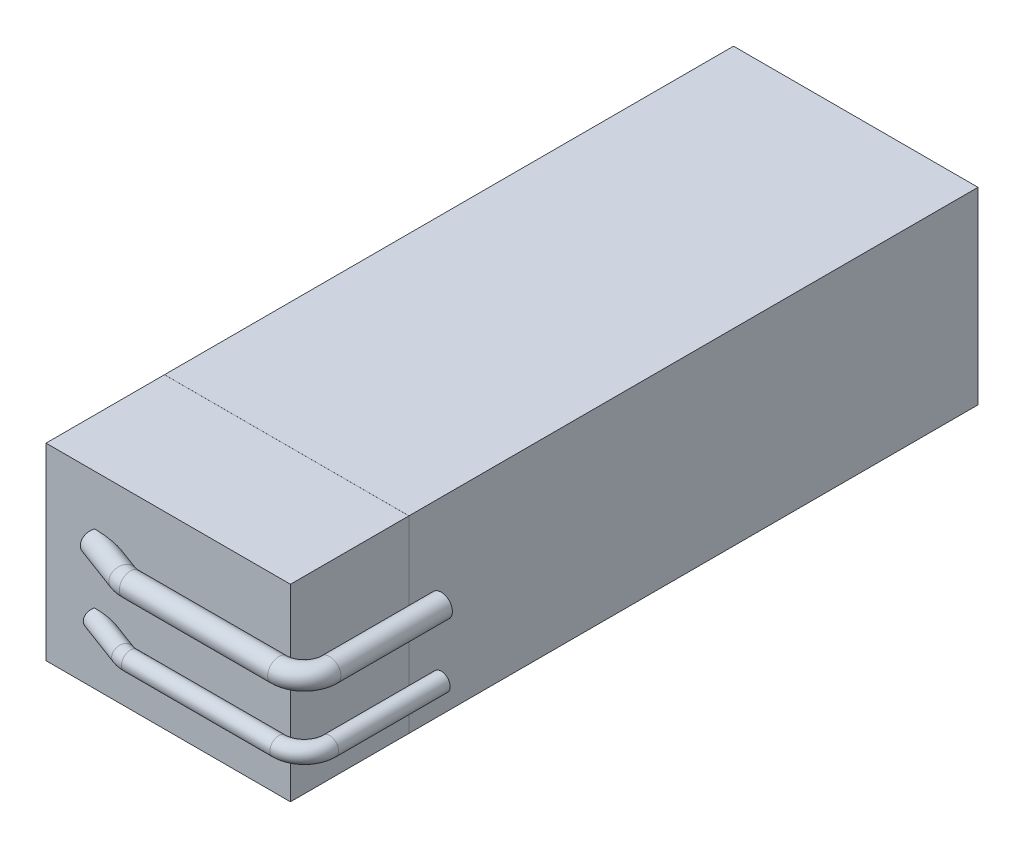
ISO-10303-21;
HEADER;
FILE_DESCRIPTION(('STEP AP214'),'2;1');
FILE_NAME('part.step','',(''),(''),'','','');
FILE_SCHEMA(('AUTOMOTIVE_DESIGN { 1 0 10303 214 1 1 1 1 }'));
ENDSEC;
DATA;
#1=APPLICATION_CONTEXT('core data for automotive mechanical design processes');
#2=APPLICATION_PROTOCOL_DEFINITION('international standard','automotive_design',2000,#1);
#3=PRODUCT_CONTEXT('',#1,'mechanical');
#4=PRODUCT('Part','Part','',(#3));
#5=PRODUCT_RELATED_PRODUCT_CATEGORY('part','',(#4));
#6=PRODUCT_DEFINITION_FORMATION('','',#4);
#7=PRODUCT_DEFINITION_CONTEXT('part definition',#1,'design');
#8=PRODUCT_DEFINITION('design','',#6,#7);
#9=PRODUCT_DEFINITION_SHAPE('','',#8);
#10=(LENGTH_UNIT() NAMED_UNIT(*) SI_UNIT(.MILLI.,.METRE.));
#11=(NAMED_UNIT(*) PLANE_ANGLE_UNIT() SI_UNIT($,.RADIAN.));
#12=(NAMED_UNIT(*) SI_UNIT($,.STERADIAN.) SOLID_ANGLE_UNIT());
#13=UNCERTAINTY_MEASURE_WITH_UNIT(LENGTH_MEASURE(1.E-05),#10,'distance_accuracy_value','');
#14=(GEOMETRIC_REPRESENTATION_CONTEXT(3) GLOBAL_UNCERTAINTY_ASSIGNED_CONTEXT((#13)) GLOBAL_UNIT_ASSIGNED_CONTEXT((#10,
#11,#12)) REPRESENTATION_CONTEXT('',''));
#15=CARTESIAN_POINT('',(0.,0.,0.));
#16=DIRECTION('',(0.,0.,1.));
#17=DIRECTION('',(1.,0.,0.));
#18=AXIS2_PLACEMENT_3D('',#15,#16,#17);
#19=CARTESIAN_POINT('',(48.,37.,0.));
#20=DIRECTION('',(0.,-1.,0.));
#21=DIRECTION('',(0.,0.,-1.));
#22=AXIS2_PLACEMENT_3D('',#19,#20,#21);
#23=PLANE('',#22);
#24=DIRECTION('',(1.,0.,0.));
#25=VECTOR('',#24,1.);
#26=CARTESIAN_POINT('',(0.,37.,111.742100003703));
#27=LINE('',#26,#25);
#28=CARTESIAN_POINT('',(0.,37.,111.742100003703));
#29=VERTEX_POINT('',#28);
#30=CARTESIAN_POINT('',(48.,37.,111.742100003703));
#31=VERTEX_POINT('',#30);
#32=EDGE_CURVE('E114',#29,#31,#27,.T.);
#33=ORIENTED_EDGE('',*,*,#32,.F.);
#34=DIRECTION('',(0.,0.,1.));
#35=VECTOR('',#34,1.);
#36=CARTESIAN_POINT('',(0.,37.,0.));
#37=LINE('',#36,#35);
#38=CARTESIAN_POINT('',(0.,37.,135.));
#39=VERTEX_POINT('',#38);
#40=EDGE_CURVE('E59',#29,#39,#37,.T.);
#41=ORIENTED_EDGE('',*,*,#40,.T.);
#42=DIRECTION('',(-1.,0.,0.));
#43=VECTOR('',#42,1.);
#44=CARTESIAN_POINT('',(48.,37.,135.));
#45=LINE('',#44,#43);
#46=CARTESIAN_POINT('',(48.,37.,135.));
#47=VERTEX_POINT('',#46);
#48=EDGE_CURVE('E151',#47,#39,#45,.T.);
#49=ORIENTED_EDGE('',*,*,#48,.F.);
#50=DIRECTION('',(0.,0.,1.));
#51=VECTOR('',#50,1.);
#52=CARTESIAN_POINT('',(48.,37.,0.));
#53=LINE('',#52,#51);
#54=EDGE_CURVE('E130',#31,#47,#53,.T.);
#55=ORIENTED_EDGE('',*,*,#54,.F.);
#56=EDGE_LOOP('',(#33,#41,#49,#55));
#57=FACE_BOUND('',#56,.T.);
#58=ADVANCED_FACE('F56',(#57),#23,.F.);
#59=CARTESIAN_POINT('',(48.,0.,0.));
#60=DIRECTION('',(0.,1.,0.));
#61=DIRECTION('',(0.,0.,1.));
#62=AXIS2_PLACEMENT_3D('',#59,#60,#61);
#63=PLANE('',#62);
#64=DIRECTION('',(-1.,0.,0.));
#65=VECTOR('',#64,1.);
#66=CARTESIAN_POINT('',(0.,0.,111.742100003703));
#67=LINE('',#66,#65);
#68=CARTESIAN_POINT('',(48.,0.,111.742100003703));
#69=VERTEX_POINT('',#68);
#70=CARTESIAN_POINT('',(0.,0.,111.742100003703));
#71=VERTEX_POINT('',#70);
#72=EDGE_CURVE('E12',#69,#71,#67,.T.);
#73=ORIENTED_EDGE('',*,*,#72,.F.);
#74=DIRECTION('',(0.,0.,-1.));
#75=VECTOR('',#74,1.);
#76=CARTESIAN_POINT('',(48.,0.,0.));
#77=LINE('',#76,#75);
#78=CARTESIAN_POINT('',(48.,0.,135.));
#79=VERTEX_POINT('',#78);
#80=EDGE_CURVE('E148',#79,#69,#77,.T.);
#81=ORIENTED_EDGE('',*,*,#80,.F.);
#82=DIRECTION('',(-1.,0.,0.));
#83=VECTOR('',#82,1.);
#84=CARTESIAN_POINT('',(48.,0.,135.));
#85=LINE('',#84,#83);
#86=CARTESIAN_POINT('',(0.,0.,135.));
#87=VERTEX_POINT('',#86);
#88=EDGE_CURVE('E137',#79,#87,#85,.T.);
#89=ORIENTED_EDGE('',*,*,#88,.T.);
#90=DIRECTION('',(0.,0.,-1.));
#91=VECTOR('',#90,1.);
#92=CARTESIAN_POINT('',(0.,0.,0.));
#93=LINE('',#92,#91);
#94=EDGE_CURVE('E141',#87,#71,#93,.T.);
#95=ORIENTED_EDGE('',*,*,#94,.T.);
#96=EDGE_LOOP('',(#73,#81,#89,#95));
#97=FACE_BOUND('',#96,.T.);
#98=ADVANCED_FACE('F220',(#97),#63,.F.);
#99=CARTESIAN_POINT('',(48.,0.,0.));
#100=DIRECTION('',(1.,0.,0.));
#101=DIRECTION('',(0.,0.,-1.));
#102=AXIS2_PLACEMENT_3D('',#99,#100,#101);
#103=PLANE('',#102);
#104=ORIENTED_EDGE('',*,*,#80,.T.);
#105=DIRECTION('',(0.,-1.,0.));
#106=VECTOR('',#105,1.);
#107=CARTESIAN_POINT('',(48.,0.,111.742100003703));
#108=LINE('',#107,#106);
#109=EDGE_CURVE('E66',#31,#69,#108,.T.);
#110=ORIENTED_EDGE('',*,*,#109,.F.);
#111=ORIENTED_EDGE('',*,*,#54,.T.);
#112=DIRECTION('',(0.,-1.,0.));
#113=VECTOR('',#112,1.);
#114=CARTESIAN_POINT('',(48.,0.,135.));
#115=LINE('',#114,#113);
#116=EDGE_CURVE('E155',#47,#79,#115,.T.);
#117=ORIENTED_EDGE('',*,*,#116,.T.);
#118=EDGE_LOOP('',(#104,#110,#111,#117));
#119=FACE_BOUND('',#118,.T.);
#120=ADVANCED_FACE('F215',(#119),#103,.T.);
#121=CARTESIAN_POINT('',(0.,0.,0.));
#122=DIRECTION('',(1.,0.,0.));
#123=DIRECTION('',(0.,0.,-1.));
#124=AXIS2_PLACEMENT_3D('',#121,#122,#123);
#125=PLANE('',#124);
#126=DIRECTION('',(0.,1.,0.));
#127=VECTOR('',#126,1.);
#128=CARTESIAN_POINT('',(0.,0.,111.742100003703));
#129=LINE('',#128,#127);
#130=EDGE_CURVE('E117',#71,#29,#129,.T.);
#131=ORIENTED_EDGE('',*,*,#130,.F.);
#132=ORIENTED_EDGE('',*,*,#94,.F.);
#133=DIRECTION('',(0.,-1.,0.));
#134=VECTOR('',#133,1.);
#135=CARTESIAN_POINT('',(0.,0.,135.));
#136=LINE('',#135,#134);
#137=EDGE_CURVE('E135',#39,#87,#136,.T.);
#138=ORIENTED_EDGE('',*,*,#137,.F.);
#139=ORIENTED_EDGE('',*,*,#40,.F.);
#140=EDGE_LOOP('',(#131,#132,#138,#139));
#141=FACE_BOUND('',#140,.T.);
#142=ADVANCED_FACE('F134',(#141),#125,.F.);
#143=CARTESIAN_POINT('',(48.,0.,135.));
#144=DIRECTION('',(0.,0.,-1.));
#145=DIRECTION('',(-1.,0.,0.));
#146=AXIS2_PLACEMENT_3D('',#143,#144,#145);
#147=PLANE('',#146);
#148=DIRECTION('',(0.,-1.,0.));
#149=VECTOR('',#148,1.);
#150=CARTESIAN_POINT('',(9.55982750656041,0.,135.));
#151=LINE('',#150,#149);
#152=CARTESIAN_POINT('',(9.55982750656041,27.1877252010003,135.));
#153=VERTEX_POINT('',#152);
#154=CARTESIAN_POINT('',(9.55982750656041,22.8122747989997,135.));
#155=VERTEX_POINT('',#154);
#156=EDGE_CURVE('E168',#153,#155,#151,.T.);
#157=ORIENTED_EDGE('',*,*,#156,.F.);
#158=CARTESIAN_POINT('',(9.55982750656043,25.,135.));
#159=DIRECTION('',(0.,0.,-1.));
#160=DIRECTION('',(-1.,0.,0.));
#161=AXIS2_PLACEMENT_3D('',#158,#159,#160);
#162=ELLIPSE('',#161,6.26967326638381,2.18772520100031);
#163=EDGE_CURVE('E188',#155,#153,#162,.F.);
#164=ORIENTED_EDGE('',*,*,#163,.F.);
#165=EDGE_LOOP('',(#157,#164));
#166=FACE_BOUND('',#165,.T.);
#167=DIRECTION('',(0.,-1.,0.));
#168=VECTOR('',#167,1.);
#169=CARTESIAN_POINT('',(9.55982750656041,0.,135.));
#170=LINE('',#169,#168);
#171=CARTESIAN_POINT('',(9.55982750656041,13.75,135.));
#172=VERTEX_POINT('',#171);
#173=CARTESIAN_POINT('',(9.55982750656041,10.25,135.));
#174=VERTEX_POINT('',#173);
#175=EDGE_CURVE('E163',#172,#174,#170,.T.);
#176=ORIENTED_EDGE('',*,*,#175,.F.);
#177=CARTESIAN_POINT('',(9.55982750656043,12.,135.));
#178=DIRECTION('',(0.,0.,-1.));
#179=DIRECTION('',(-1.,0.,0.));
#180=AXIS2_PLACEMENT_3D('',#177,#178,#179);
#181=ELLIPSE('',#180,5.01522230084241,1.75);
#182=EDGE_CURVE('E162',#174,#172,#181,.F.);
#183=ORIENTED_EDGE('',*,*,#182,.F.);
#184=EDGE_LOOP('',(#176,#183));
#185=FACE_BOUND('',#184,.T.);
#186=ORIENTED_EDGE('',*,*,#137,.T.);
#187=ORIENTED_EDGE('',*,*,#88,.F.);
#188=ORIENTED_EDGE('',*,*,#116,.F.);
#189=ORIENTED_EDGE('',*,*,#48,.T.);
#190=EDGE_LOOP('',(#186,#187,#188,#189));
#191=FACE_BOUND('',#190,.T.);
#192=ADVANCED_FACE('F219',(#166,#185,#191),#147,.F.);
#193=CARTESIAN_POINT('',(9.55982750656041,12.,135.));
#194=DIRECTION('',(0.937145933275446,0.,0.348937673152804));
#195=DIRECTION('',(0.348937673152804,0.,-0.937145933275446));
#196=AXIS2_PLACEMENT_3D('',#193,#194,#195);
#197=PLANE('',#196);
#198=CARTESIAN_POINT('',(9.55982750656041,12.,135.));
#199=DIRECTION('',(0.937145933275446,0.,0.348937673152804));
#200=DIRECTION('',(0.348937673152804,0.,-0.937145933275446));
#201=AXIS2_PLACEMENT_3D('',#198,#199,#200);
#202=CIRCLE('',#201,1.75);
#203=EDGE_CURVE('E158',#172,#174,#202,.T.);
#204=ORIENTED_EDGE('',*,*,#203,.F.);
#205=ORIENTED_EDGE('',*,*,#175,.T.);
#206=EDGE_LOOP('',(#204,#205));
#207=FACE_BOUND('',#206,.T.);
#208=ADVANCED_FACE('F280',(#207),#197,.F.);
#209=CARTESIAN_POINT('',(18.4574449031654,12.,138.312946042591));
#210=DIRECTION('',(-0.937145933275446,0.,-0.348937673152804));
#211=DIRECTION('',(-0.348937673152804,0.,0.937145933275446));
#212=AXIS2_PLACEMENT_3D('',#209,#210,#211);
#213=CYLINDRICAL_SURFACE('',#212,1.75);
#214=CARTESIAN_POINT('',(18.4574449031654,12.,138.312946042591));
#215=DIRECTION('',(0.937145933275445,0.,0.348937673152806));
#216=DIRECTION('',(0.348937673152806,0.,-0.937145933275445));
#217=AXIS2_PLACEMENT_3D('',#214,#215,#216);
#218=CIRCLE('',#217,1.75);
#219=CARTESIAN_POINT('',(17.846803975148,12.,139.952951425823));
#220=VERTEX_POINT('',#219);
#221=EDGE_CURVE('E164',#220,#220,#218,.T.);
#222=ORIENTED_EDGE('',*,*,#221,.F.);
#223=EDGE_LOOP('',(#222));
#224=FACE_BOUND('',#223,.T.);
#225=ORIENTED_EDGE('',*,*,#203,.T.);
#226=ORIENTED_EDGE('',*,*,#182,.T.);
#227=EDGE_LOOP('',(#225,#226));
#228=FACE_BOUND('',#227,.T.);
#229=ADVANCED_FACE('F277',(#224,#228),#213,.T.);
#230=CARTESIAN_POINT('',(54.3424294324666,12.,111.732100003703));
#231=DIRECTION('',(0.,0.,-1.));
#232=DIRECTION('',(-1.,0.,0.));
#233=AXIS2_PLACEMENT_3D('',#230,#231,#232);
#234=PLANE('',#233);
#235=CARTESIAN_POINT('',(54.3424294324666,12.,111.732100003703));
#236=DIRECTION('',(0.,0.,-1.));
#237=DIRECTION('',(-1.,0.,0.));
#238=AXIS2_PLACEMENT_3D('',#235,#236,#237);
#239=CIRCLE('',#238,1.75);
#240=CARTESIAN_POINT('',(52.5924294324666,12.,111.732100003703));
#241=VERTEX_POINT('',#240);
#242=EDGE_CURVE('E180',#241,#241,#239,.T.);
#243=ORIENTED_EDGE('',*,*,#242,.T.);
#244=EDGE_LOOP('',(#243));
#245=FACE_BOUND('',#244,.T.);
#246=ADVANCED_FACE('F258',(#245),#234,.T.);
#247=CARTESIAN_POINT('',(54.3424294324666,12.,111.732100003703));
#248=DIRECTION('',(0.,0.,1.));
#249=DIRECTION('',(1.,0.,0.));
#250=AXIS2_PLACEMENT_3D('',#247,#248,#249);
#251=CYLINDRICAL_SURFACE('',#250,1.75);
#252=CARTESIAN_POINT('',(54.3424294324666,12.,133.627216376214));
#253=DIRECTION('',(0.,0.,-1.));
#254=DIRECTION('',(-1.,0.,0.));
#255=AXIS2_PLACEMENT_3D('',#252,#253,#254);
#256=CIRCLE('',#255,1.75);
#257=CARTESIAN_POINT('',(56.092429432466,12.,133.627216376214));
#258=VERTEX_POINT('',#257);
#259=EDGE_CURVE('E176',#258,#258,#256,.T.);
#260=ORIENTED_EDGE('',*,*,#259,.T.);
#261=EDGE_LOOP('',(#260));
#262=FACE_BOUND('',#261,.T.);
#263=ORIENTED_EDGE('',*,*,#242,.F.);
#264=EDGE_LOOP('',(#263));
#265=FACE_BOUND('',#264,.T.);
#266=ADVANCED_FACE('F262',(#262,#265),#251,.T.);
#267=CARTESIAN_POINT('',(49.3424294324666,12.,133.627216376214));
#268=DIRECTION('',(0.,-1.,0.));
#269=DIRECTION('',(0.,0.,-1.));
#270=AXIS2_PLACEMENT_3D('',#267,#268,#269);
#271=TOROIDAL_SURFACE('',#270,4.99999999999938,1.75);
#272=CARTESIAN_POINT('',(49.3424294324665,12.,138.627216376214));
#273=DIRECTION('',(1.,0.,0.));
#274=DIRECTION('',(0.,0.,-1.));
#275=AXIS2_PLACEMENT_3D('',#272,#273,#274);
#276=CIRCLE('',#275,1.75);
#277=CARTESIAN_POINT('',(49.3424294324665,12.,140.377216376213));
#278=VERTEX_POINT('',#277);
#279=EDGE_CURVE('E172',#278,#278,#276,.T.);
#280=CARTESIAN_POINT('',(49.3424294324666,12.,133.627216376214));
#281=DIRECTION('',(0.,-1.,0.));
#282=DIRECTION('',(0.,0.,-1.));
#283=AXIS2_PLACEMENT_3D('',#280,#281,#282);
#284=CIRCLE('',#283,6.74999999999938);
#285=EDGE_CURVE('',#258,#278,#284,.T.);
#286=ORIENTED_EDGE('',*,*,#259,.F.);
#287=ORIENTED_EDGE('',*,*,#279,.T.);
#288=ORIENTED_EDGE('',*,*,#285,.T.);
#289=ORIENTED_EDGE('',*,*,#285,.F.);
#290=EDGE_LOOP('',(#286,#288,#287,#289));
#291=FACE_BOUND('',#290,.T.);
#292=ADVANCED_FACE('F265',(#291),#271,.T.);
#293=CARTESIAN_POINT('',(49.3424294324666,12.,138.627216376214));
#294=DIRECTION('',(-1.,0.,0.));
#295=DIRECTION('',(0.,0.,1.));
#296=AXIS2_PLACEMENT_3D('',#293,#294,#295);
#297=CYLINDRICAL_SURFACE('',#296,1.75);
#298=CARTESIAN_POINT('',(20.2021332689294,12.,138.627216376214));
#299=DIRECTION('',(1.,0.,0.));
#300=DIRECTION('',(0.,0.,-1.));
#301=AXIS2_PLACEMENT_3D('',#298,#299,#300);
#302=CIRCLE('',#301,1.75);
#303=CARTESIAN_POINT('',(20.2021332689294,12.,140.377216376214));
#304=VERTEX_POINT('',#303);
#305=EDGE_CURVE('E169',#304,#304,#302,.T.);
#306=ORIENTED_EDGE('',*,*,#305,.T.);
#307=EDGE_LOOP('',(#306));
#308=FACE_BOUND('',#307,.T.);
#309=ORIENTED_EDGE('',*,*,#279,.F.);
#310=EDGE_LOOP('',(#309));
#311=FACE_BOUND('',#310,.T.);
#312=ADVANCED_FACE('F269',(#308,#311),#297,.T.);
#313=CARTESIAN_POINT('',(20.2021332689294,12.,133.627216376214));
#314=DIRECTION('',(0.,-1.,0.));
#315=DIRECTION('',(0.,0.,-1.));
#316=AXIS2_PLACEMENT_3D('',#313,#314,#315);
#317=TOROIDAL_SURFACE('',#316,5.,1.75);
#318=CARTESIAN_POINT('',(20.2021332689294,12.,133.627216376214));
#319=DIRECTION('',(0.,-1.,0.));
#320=DIRECTION('',(0.,0.,-1.));
#321=AXIS2_PLACEMENT_3D('',#318,#319,#320);
#322=CIRCLE('',#321,6.75000000000001);
#323=EDGE_CURVE('',#304,#220,#322,.T.);
#324=ORIENTED_EDGE('',*,*,#305,.F.);
#325=ORIENTED_EDGE('',*,*,#221,.T.);
#326=ORIENTED_EDGE('',*,*,#323,.T.);
#327=ORIENTED_EDGE('',*,*,#323,.F.);
#328=EDGE_LOOP('',(#324,#326,#325,#327));
#329=FACE_BOUND('',#328,.T.);
#330=ADVANCED_FACE('F256',(#329),#317,.T.);
#331=CARTESIAN_POINT('',(9.55982750656041,25.,135.));
#332=DIRECTION('',(0.937145933275446,0.,0.348937673152804));
#333=DIRECTION('',(0.348937673152804,0.,-0.937145933275446));
#334=AXIS2_PLACEMENT_3D('',#331,#332,#333);
#335=PLANE('',#334);
#336=CARTESIAN_POINT('',(9.55982750656041,25.,135.));
#337=DIRECTION('',(0.937145933275446,0.,0.348937673152804));
#338=DIRECTION('',(0.348937673152804,0.,-0.937145933275446));
#339=AXIS2_PLACEMENT_3D('',#336,#337,#338);
#340=CIRCLE('',#339,2.18772520100031);
#341=EDGE_CURVE('E184',#153,#155,#340,.T.);
#342=ORIENTED_EDGE('',*,*,#341,.F.);
#343=ORIENTED_EDGE('',*,*,#156,.T.);
#344=EDGE_LOOP('',(#342,#343));
#345=FACE_BOUND('',#344,.T.);
#346=ADVANCED_FACE('F252',(#345),#335,.F.);
#347=CARTESIAN_POINT('',(18.4574449031654,25.,138.312946042591));
#348=DIRECTION('',(-0.937145933275446,0.,-0.348937673152804));
#349=DIRECTION('',(-0.348937673152804,0.,0.937145933275446));
#350=AXIS2_PLACEMENT_3D('',#347,#348,#349);
#351=CYLINDRICAL_SURFACE('',#350,2.18772520100031);
#352=CARTESIAN_POINT('',(18.4574449031654,25.,138.312946042591));
#353=DIRECTION('',(0.937145933275445,0.,0.348937673152806));
#354=DIRECTION('',(0.348937673152806,0.,-0.937145933275445));
#355=AXIS2_PLACEMENT_3D('',#352,#353,#354);
#356=CIRCLE('',#355,2.18772520100031);
#357=CARTESIAN_POINT('',(17.6940651620306,25.,140.363163817833));
#358=VERTEX_POINT('',#357);
#359=EDGE_CURVE('E124',#358,#358,#356,.T.);
#360=ORIENTED_EDGE('',*,*,#359,.F.);
#361=EDGE_LOOP('',(#360));
#362=FACE_BOUND('',#361,.T.);
#363=ORIENTED_EDGE('',*,*,#341,.T.);
#364=ORIENTED_EDGE('',*,*,#163,.T.);
#365=EDGE_LOOP('',(#363,#364));
#366=FACE_BOUND('',#365,.T.);
#367=ADVANCED_FACE('F249',(#362,#366),#351,.T.);
#368=CARTESIAN_POINT('',(54.3424294324666,25.,111.732100003703));
#369=DIRECTION('',(0.,0.,-1.));
#370=DIRECTION('',(-1.,0.,0.));
#371=AXIS2_PLACEMENT_3D('',#368,#369,#370);
#372=PLANE('',#371);
#373=CARTESIAN_POINT('',(54.3424294324666,25.,111.732100003703));
#374=DIRECTION('',(0.,0.,-1.));
#375=DIRECTION('',(-1.,0.,0.));
#376=AXIS2_PLACEMENT_3D('',#373,#374,#375);
#377=CIRCLE('',#376,2.18772520100031);
#378=CARTESIAN_POINT('',(52.1547042314663,25.,111.732100003703));
#379=VERTEX_POINT('',#378);
#380=EDGE_CURVE('E204',#379,#379,#377,.T.);
#381=ORIENTED_EDGE('',*,*,#380,.T.);
#382=EDGE_LOOP('',(#381));
#383=FACE_BOUND('',#382,.T.);
#384=ADVANCED_FACE('F233',(#383),#372,.T.);
#385=CARTESIAN_POINT('',(54.3424294324666,25.,111.732100003703));
#386=DIRECTION('',(0.,0.,1.));
#387=DIRECTION('',(1.,0.,0.));
#388=AXIS2_PLACEMENT_3D('',#385,#386,#387);
#389=CYLINDRICAL_SURFACE('',#388,2.18772520100031);
#390=CARTESIAN_POINT('',(54.3424294324666,25.,133.627216376214));
#391=DIRECTION('',(0.,0.,-1.));
#392=DIRECTION('',(-1.,0.,0.));
#393=AXIS2_PLACEMENT_3D('',#390,#391,#392);
#394=CIRCLE('',#393,2.18772520100031);
#395=CARTESIAN_POINT('',(56.5301546334663,25.,133.627216376214));
#396=VERTEX_POINT('',#395);
#397=EDGE_CURVE('E200',#396,#396,#394,.T.);
#398=ORIENTED_EDGE('',*,*,#397,.T.);
#399=EDGE_LOOP('',(#398));
#400=FACE_BOUND('',#399,.T.);
#401=ORIENTED_EDGE('',*,*,#380,.F.);
#402=EDGE_LOOP('',(#401));
#403=FACE_BOUND('',#402,.T.);
#404=ADVANCED_FACE('F234',(#400,#403),#389,.T.);
#405=CARTESIAN_POINT('',(49.3424294324666,25.,133.627216376214));
#406=DIRECTION('',(0.,-1.,0.));
#407=DIRECTION('',(0.,0.,-1.));
#408=AXIS2_PLACEMENT_3D('',#405,#406,#407);
#409=TOROIDAL_SURFACE('',#408,4.99999999999938,2.18772520100031);
#410=CARTESIAN_POINT('',(49.3424294324665,25.,138.627216376214));
#411=DIRECTION('',(1.,0.,0.));
#412=DIRECTION('',(0.,0.,-1.));
#413=AXIS2_PLACEMENT_3D('',#410,#411,#412);
#414=CIRCLE('',#413,2.18772520100031);
#415=CARTESIAN_POINT('',(49.3424294324665,25.,140.814941577214));
#416=VERTEX_POINT('',#415);
#417=EDGE_CURVE('E196',#416,#416,#414,.T.);
#418=CARTESIAN_POINT('',(49.3424294324666,25.,133.627216376214));
#419=DIRECTION('',(0.,-1.,0.));
#420=DIRECTION('',(0.,0.,-1.));
#421=AXIS2_PLACEMENT_3D('',#418,#419,#420);
#422=CIRCLE('',#421,7.18772520099969);
#423=EDGE_CURVE('',#396,#416,#422,.T.);
#424=ORIENTED_EDGE('',*,*,#397,.F.);
#425=ORIENTED_EDGE('',*,*,#417,.T.);
#426=ORIENTED_EDGE('',*,*,#423,.T.);
#427=ORIENTED_EDGE('',*,*,#423,.F.);
#428=EDGE_LOOP('',(#424,#426,#425,#427));
#429=FACE_BOUND('',#428,.T.);
#430=ADVANCED_FACE('F237',(#429),#409,.T.);
#431=CARTESIAN_POINT('',(49.3424294324666,25.,138.627216376214));
#432=DIRECTION('',(-1.,0.,0.));
#433=DIRECTION('',(0.,0.,1.));
#434=AXIS2_PLACEMENT_3D('',#431,#432,#433);
#435=CYLINDRICAL_SURFACE('',#434,2.18772520100031);
#436=CARTESIAN_POINT('',(20.2021332689294,25.,138.627216376214));
#437=DIRECTION('',(1.,0.,0.));
#438=DIRECTION('',(0.,0.,-1.));
#439=AXIS2_PLACEMENT_3D('',#436,#437,#438);
#440=CIRCLE('',#439,2.18772520100031);
#441=CARTESIAN_POINT('',(20.2021332689294,25.,140.814941577214));
#442=VERTEX_POINT('',#441);
#443=EDGE_CURVE('E192',#442,#442,#440,.T.);
#444=ORIENTED_EDGE('',*,*,#443,.T.);
#445=EDGE_LOOP('',(#444));
#446=FACE_BOUND('',#445,.T.);
#447=ORIENTED_EDGE('',*,*,#417,.F.);
#448=EDGE_LOOP('',(#447));
#449=FACE_BOUND('',#448,.T.);
#450=ADVANCED_FACE('F241',(#446,#449),#435,.T.);
#451=CARTESIAN_POINT('',(20.2021332689294,25.,133.627216376214));
#452=DIRECTION('',(0.,-1.,0.));
#453=DIRECTION('',(0.,0.,-1.));
#454=AXIS2_PLACEMENT_3D('',#451,#452,#453);
#455=TOROIDAL_SURFACE('',#454,5.,2.18772520100031);
#456=CARTESIAN_POINT('',(20.2021332689294,25.,133.627216376214));
#457=DIRECTION('',(0.,-1.,0.));
#458=DIRECTION('',(0.,0.,-1.));
#459=AXIS2_PLACEMENT_3D('',#456,#457,#458);
#460=CIRCLE('',#459,7.18772520100031);
#461=EDGE_CURVE('',#442,#358,#460,.T.);
#462=ORIENTED_EDGE('',*,*,#443,.F.);
#463=ORIENTED_EDGE('',*,*,#359,.T.);
#464=ORIENTED_EDGE('',*,*,#461,.T.);
#465=ORIENTED_EDGE('',*,*,#461,.F.);
#466=EDGE_LOOP('',(#462,#464,#463,#465));
#467=FACE_BOUND('',#466,.T.);
#468=ADVANCED_FACE('F232',(#467),#455,.T.);
#469=CARTESIAN_POINT('',(0.,0.,111.742100003703));
#470=DIRECTION('',(0.,0.,-1.));
#471=DIRECTION('',(-1.,0.,0.));
#472=AXIS2_PLACEMENT_3D('',#469,#470,#471);
#473=PLANE('',#472);
#474=ORIENTED_EDGE('',*,*,#130,.T.);
#475=ORIENTED_EDGE('',*,*,#32,.T.);
#476=ORIENTED_EDGE('',*,*,#109,.T.);
#477=ORIENTED_EDGE('',*,*,#72,.T.);
#478=EDGE_LOOP('',(#474,#475,#476,#477));
#479=FACE_BOUND('',#478,.T.);
#480=ADVANCED_FACE('F118',(#479),#473,.T.);
#481=CLOSED_SHELL('',(#58,#98,#120,#142,#192,#208,#229,#246,#266,#292,#312,#330,#346,#367,#384,
#404,#430,#450,#468,#480));
#482=MANIFOLD_SOLID_BREP('B2',#481);
#483=CARTESIAN_POINT('',(48.,0.,0.));
#484=DIRECTION('',(0.,0.,1.));
#485=DIRECTION('',(1.,0.,0.));
#486=AXIS2_PLACEMENT_3D('',#483,#484,#485);
#487=PLANE('',#486);
#488=DIRECTION('',(0.,1.,0.));
#489=VECTOR('',#488,1.);
#490=CARTESIAN_POINT('',(0.,0.,0.));
#491=LINE('',#490,#489);
#492=CARTESIAN_POINT('',(0.,0.,0.));
#493=VERTEX_POINT('',#492);
#494=CARTESIAN_POINT('',(0.,37.,0.));
#495=VERTEX_POINT('',#494);
#496=EDGE_CURVE('E549',#493,#495,#491,.T.);
#497=ORIENTED_EDGE('',*,*,#496,.T.);
#498=DIRECTION('',(-1.,0.,0.));
#499=VECTOR('',#498,1.);
#500=CARTESIAN_POINT('',(48.,37.,0.));
#501=LINE('',#500,#499);
#502=CARTESIAN_POINT('',(48.,37.,0.));
#503=VERTEX_POINT('',#502);
#504=EDGE_CURVE('E54',#503,#495,#501,.T.);
#505=ORIENTED_EDGE('',*,*,#504,.F.);
#506=DIRECTION('',(0.,1.,0.));
#507=VECTOR('',#506,1.);
#508=CARTESIAN_POINT('',(48.,0.,0.));
#509=LINE('',#508,#507);
#510=CARTESIAN_POINT('',(48.,0.,0.));
#511=VERTEX_POINT('',#510);
#512=EDGE_CURVE('E543',#511,#503,#509,.T.);
#513=ORIENTED_EDGE('',*,*,#512,.F.);
#514=DIRECTION('',(-1.,0.,0.));
#515=VECTOR('',#514,1.);
#516=CARTESIAN_POINT('',(48.,0.,0.));
#517=LINE('',#516,#515);
#518=EDGE_CURVE('E496',#511,#493,#517,.T.);
#519=ORIENTED_EDGE('',*,*,#518,.T.);
#520=EDGE_LOOP('',(#497,#505,#513,#519));
#521=FACE_BOUND('',#520,.T.);
#522=ADVANCED_FACE('F488',(#521),#487,.F.);
#523=CARTESIAN_POINT('',(0.,0.,0.));
#524=DIRECTION('',(1.,0.,0.));
#525=DIRECTION('',(0.,0.,-1.));
#526=AXIS2_PLACEMENT_3D('',#523,#524,#525);
#527=PLANE('',#526);
#528=DIRECTION('',(0.,0.,-1.));
#529=VECTOR('',#528,1.);
#530=CARTESIAN_POINT('',(0.,0.,0.));
#531=LINE('',#530,#529);
#532=CARTESIAN_POINT('',(0.,0.,111.732100003703));
#533=VERTEX_POINT('',#532);
#534=EDGE_CURVE('E534',#533,#493,#531,.T.);
#535=ORIENTED_EDGE('',*,*,#534,.F.);
#536=DIRECTION('',(0.,1.,0.));
#537=VECTOR('',#536,1.);
#538=CARTESIAN_POINT('',(0.,0.,111.732100003703));
#539=LINE('',#538,#537);
#540=CARTESIAN_POINT('',(0.,37.,111.732100003703));
#541=VERTEX_POINT('',#540);
#542=EDGE_CURVE('E573',#533,#541,#539,.T.);
#543=ORIENTED_EDGE('',*,*,#542,.T.);
#544=DIRECTION('',(0.,0.,1.));
#545=VECTOR('',#544,1.);
#546=CARTESIAN_POINT('',(0.,37.,0.));
#547=LINE('',#546,#545);
#548=EDGE_CURVE('E544',#495,#541,#547,.T.);
#549=ORIENTED_EDGE('',*,*,#548,.F.);
#550=ORIENTED_EDGE('',*,*,#496,.F.);
#551=EDGE_LOOP('',(#535,#543,#549,#550));
#552=FACE_BOUND('',#551,.T.);
#553=ADVANCED_FACE('F551',(#552),#527,.F.);
#554=CARTESIAN_POINT('',(48.,0.,0.));
#555=DIRECTION('',(1.,0.,0.));
#556=DIRECTION('',(0.,0.,-1.));
#557=AXIS2_PLACEMENT_3D('',#554,#555,#556);
#558=PLANE('',#557);
#559=DIRECTION('',(0.,-1.,0.));
#560=VECTOR('',#559,1.);
#561=CARTESIAN_POINT('',(48.,0.,111.732100003703));
#562=LINE('',#561,#560);
#563=CARTESIAN_POINT('',(48.,37.,111.732100003703));
#564=VERTEX_POINT('',#563);
#565=CARTESIAN_POINT('',(48.,0.,111.732100003703));
#566=VERTEX_POINT('',#565);
#567=EDGE_CURVE('E558',#564,#566,#562,.T.);
#568=ORIENTED_EDGE('',*,*,#567,.T.);
#569=DIRECTION('',(0.,0.,-1.));
#570=VECTOR('',#569,1.);
#571=CARTESIAN_POINT('',(48.,0.,0.));
#572=LINE('',#571,#570);
#573=EDGE_CURVE('E518',#566,#511,#572,.T.);
#574=ORIENTED_EDGE('',*,*,#573,.T.);
#575=ORIENTED_EDGE('',*,*,#512,.T.);
#576=DIRECTION('',(0.,0.,1.));
#577=VECTOR('',#576,1.);
#578=CARTESIAN_POINT('',(48.,37.,0.));
#579=LINE('',#578,#577);
#580=EDGE_CURVE('E563',#503,#564,#579,.T.);
#581=ORIENTED_EDGE('',*,*,#580,.T.);
#582=EDGE_LOOP('',(#568,#574,#575,#581));
#583=FACE_BOUND('',#582,.T.);
#584=ADVANCED_FACE('F578',(#583),#558,.T.);
#585=CARTESIAN_POINT('',(48.,0.,0.));
#586=DIRECTION('',(0.,1.,0.));
#587=DIRECTION('',(0.,0.,1.));
#588=AXIS2_PLACEMENT_3D('',#585,#586,#587);
#589=PLANE('',#588);
#590=ORIENTED_EDGE('',*,*,#573,.F.);
#591=DIRECTION('',(-1.,0.,0.));
#592=VECTOR('',#591,1.);
#593=CARTESIAN_POINT('',(0.,0.,111.732100003703));
#594=LINE('',#593,#592);
#595=EDGE_CURVE('E539',#566,#533,#594,.T.);
#596=ORIENTED_EDGE('',*,*,#595,.T.);
#597=ORIENTED_EDGE('',*,*,#534,.T.);
#598=ORIENTED_EDGE('',*,*,#518,.F.);
#599=EDGE_LOOP('',(#590,#596,#597,#598));
#600=FACE_BOUND('',#599,.T.);
#601=ADVANCED_FACE('F536',(#600),#589,.F.);
#602=CARTESIAN_POINT('',(48.,37.,0.));
#603=DIRECTION('',(0.,-1.,0.));
#604=DIRECTION('',(0.,0.,-1.));
#605=AXIS2_PLACEMENT_3D('',#602,#603,#604);
#606=PLANE('',#605);
#607=ORIENTED_EDGE('',*,*,#548,.T.);
#608=DIRECTION('',(1.,0.,0.));
#609=VECTOR('',#608,1.);
#610=CARTESIAN_POINT('',(0.,37.,111.732100003703));
#611=LINE('',#610,#609);
#612=EDGE_CURVE('E506',#541,#564,#611,.T.);
#613=ORIENTED_EDGE('',*,*,#612,.T.);
#614=ORIENTED_EDGE('',*,*,#580,.F.);
#615=ORIENTED_EDGE('',*,*,#504,.T.);
#616=EDGE_LOOP('',(#607,#613,#614,#615));
#617=FACE_BOUND('',#616,.T.);
#618=ADVANCED_FACE('F576',(#617),#606,.F.);
#619=CARTESIAN_POINT('',(0.,0.,111.732100003703));
#620=DIRECTION('',(0.,0.,-1.));
#621=DIRECTION('',(-1.,0.,0.));
#622=AXIS2_PLACEMENT_3D('',#619,#620,#621);
#623=PLANE('',#622);
#624=ORIENTED_EDGE('',*,*,#542,.F.);
#625=ORIENTED_EDGE('',*,*,#595,.F.);
#626=ORIENTED_EDGE('',*,*,#567,.F.);
#627=ORIENTED_EDGE('',*,*,#612,.F.);
#628=EDGE_LOOP('',(#624,#625,#626,#627));
#629=FACE_BOUND('',#628,.T.);
#630=ADVANCED_FACE('F609',(#629),#623,.F.);
#631=CLOSED_SHELL('',(#522,#553,#584,#601,#618,#630));
#632=MANIFOLD_SOLID_BREP('B6',#631);
#633=ADVANCED_BREP_SHAPE_REPRESENTATION('',(#18,#482,#632),#14);
#634=SHAPE_DEFINITION_REPRESENTATION(#9,#633);
ENDSEC;
END-ISO-10303-21;
